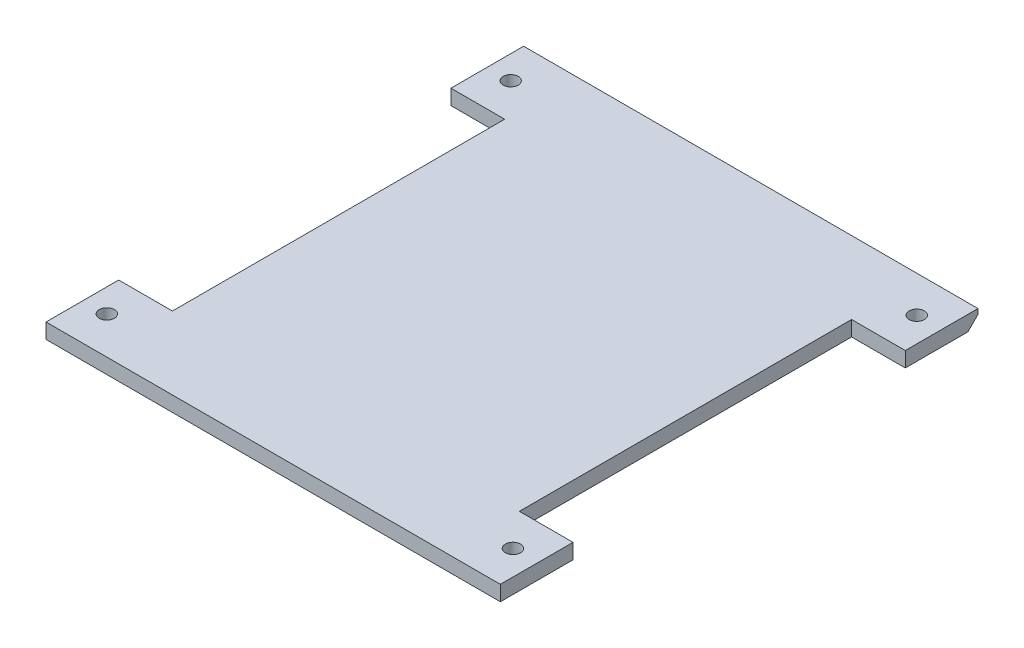
ISO-10303-21;
HEADER;
FILE_DESCRIPTION(('STEP AP214'),'2;1');
FILE_NAME('part.step','',(''),(''),'','','');
FILE_SCHEMA(('AUTOMOTIVE_DESIGN { 1 0 10303 214 1 1 1 1 }'));
ENDSEC;
DATA;
#1=APPLICATION_CONTEXT('core data for automotive mechanical design processes');
#2=APPLICATION_PROTOCOL_DEFINITION('international standard','automotive_design',2000,#1);
#3=PRODUCT_CONTEXT('',#1,'mechanical');
#4=PRODUCT('Part','Part','',(#3));
#5=PRODUCT_RELATED_PRODUCT_CATEGORY('part','',(#4));
#6=PRODUCT_DEFINITION_FORMATION('','',#4);
#7=PRODUCT_DEFINITION_CONTEXT('part definition',#1,'design');
#8=PRODUCT_DEFINITION('design','',#6,#7);
#9=PRODUCT_DEFINITION_SHAPE('','',#8);
#10=(LENGTH_UNIT() NAMED_UNIT(*) SI_UNIT(.MILLI.,.METRE.));
#11=(NAMED_UNIT(*) PLANE_ANGLE_UNIT() SI_UNIT($,.RADIAN.));
#12=(NAMED_UNIT(*) SI_UNIT($,.STERADIAN.) SOLID_ANGLE_UNIT());
#13=UNCERTAINTY_MEASURE_WITH_UNIT(LENGTH_MEASURE(1.E-05),#10,'distance_accuracy_value','');
#14=(GEOMETRIC_REPRESENTATION_CONTEXT(3) GLOBAL_UNCERTAINTY_ASSIGNED_CONTEXT((#13)) GLOBAL_UNIT_ASSIGNED_CONTEXT((#10,
#11,#12)) REPRESENTATION_CONTEXT('',''));
#15=CARTESIAN_POINT('',(0.,0.,0.));
#16=DIRECTION('',(0.,0.,1.));
#17=DIRECTION('',(1.,0.,0.));
#18=AXIS2_PLACEMENT_3D('',#15,#16,#17);
#19=CARTESIAN_POINT('',(45.0000000000001,3.,47.305));
#20=DIRECTION('',(-1.,0.,0.));
#21=DIRECTION('',(0.,0.,1.));
#22=AXIS2_PLACEMENT_3D('',#19,#20,#21);
#23=PLANE('',#22);
#24=DIRECTION('',(0.,0.,-1.));
#25=VECTOR('',#24,1.);
#26=CARTESIAN_POINT('',(45.0000000000001,0.,47.305));
#27=LINE('',#26,#25);
#28=CARTESIAN_POINT('',(45.0000000000001,0.,-32.905));
#29=VERTEX_POINT('',#28);
#30=CARTESIAN_POINT('',(45.0000000000001,0.,-45.305));
#31=VERTEX_POINT('',#30);
#32=EDGE_CURVE('E156',#29,#31,#27,.T.);
#33=ORIENTED_EDGE('',*,*,#32,.T.);
#34=DIRECTION('',(0.,0.707106781186545,-0.70710678118655));
#35=VECTOR('',#34,1.);
#36=CARTESIAN_POINT('',(45.0000000000001,2.,-47.305));
#37=LINE('',#36,#35);
#38=CARTESIAN_POINT('',(45.0000000000001,2.,-47.305));
#39=VERTEX_POINT('',#38);
#40=EDGE_CURVE('E11',#31,#39,#37,.T.);
#41=ORIENTED_EDGE('',*,*,#40,.T.);
#42=DIRECTION('',(0.,-1.,0.));
#43=VECTOR('',#42,1.);
#44=CARTESIAN_POINT('',(45.0000000000001,3.,-47.305));
#45=LINE('',#44,#43);
#46=CARTESIAN_POINT('',(45.0000000000001,3.,-47.305));
#47=VERTEX_POINT('',#46);
#48=EDGE_CURVE('E171',#47,#39,#45,.T.);
#49=ORIENTED_EDGE('',*,*,#48,.F.);
#50=DIRECTION('',(0.,0.,-1.));
#51=VECTOR('',#50,1.);
#52=CARTESIAN_POINT('',(45.0000000000001,3.,47.305));
#53=LINE('',#52,#51);
#54=CARTESIAN_POINT('',(45.0000000000001,3.,-32.905));
#55=VERTEX_POINT('',#54);
#56=EDGE_CURVE('E205',#55,#47,#53,.T.);
#57=ORIENTED_EDGE('',*,*,#56,.F.);
#58=DIRECTION('',(0.,-1.,0.));
#59=VECTOR('',#58,1.);
#60=CARTESIAN_POINT('',(45.0000000000001,3.,-32.905));
#61=LINE('',#60,#59);
#62=EDGE_CURVE('E139',#55,#29,#61,.T.);
#63=ORIENTED_EDGE('',*,*,#62,.T.);
#64=EDGE_LOOP('',(#33,#41,#49,#57,#63));
#65=FACE_BOUND('',#64,.T.);
#66=ADVANCED_FACE('F34',(#65),#23,.F.);
#67=CARTESIAN_POINT('',(-45.0000000000001,3.,47.305));
#68=DIRECTION('',(1.,0.,0.));
#69=DIRECTION('',(0.,0.,-1.));
#70=AXIS2_PLACEMENT_3D('',#67,#68,#69);
#71=PLANE('',#70);
#72=DIRECTION('',(0.,0.,1.));
#73=VECTOR('',#72,1.);
#74=CARTESIAN_POINT('',(-45.0000000000001,3.,47.305));
#75=LINE('',#74,#73);
#76=CARTESIAN_POINT('',(-45.0000000000001,3.,32.905));
#77=VERTEX_POINT('',#76);
#78=CARTESIAN_POINT('',(-45.0000000000001,3.,47.305));
#79=VERTEX_POINT('',#78);
#80=EDGE_CURVE('E199',#77,#79,#75,.T.);
#81=ORIENTED_EDGE('',*,*,#80,.F.);
#82=DIRECTION('',(0.,-1.,0.));
#83=VECTOR('',#82,1.);
#84=CARTESIAN_POINT('',(-45.0000000000001,3.,32.905));
#85=LINE('',#84,#83);
#86=CARTESIAN_POINT('',(-45.0000000000001,0.,32.905));
#87=VERTEX_POINT('',#86);
#88=EDGE_CURVE('E140',#77,#87,#85,.T.);
#89=ORIENTED_EDGE('',*,*,#88,.T.);
#90=DIRECTION('',(0.,0.,1.));
#91=VECTOR('',#90,1.);
#92=CARTESIAN_POINT('',(-45.0000000000001,0.,47.305));
#93=LINE('',#92,#91);
#94=CARTESIAN_POINT('',(-45.0000000000001,0.,47.305));
#95=VERTEX_POINT('',#94);
#96=EDGE_CURVE('E155',#87,#95,#93,.T.);
#97=ORIENTED_EDGE('',*,*,#96,.T.);
#98=DIRECTION('',(0.,-1.,0.));
#99=VECTOR('',#98,1.);
#100=CARTESIAN_POINT('',(-45.0000000000001,3.,47.305));
#101=LINE('',#100,#99);
#102=EDGE_CURVE('E165',#79,#95,#101,.T.);
#103=ORIENTED_EDGE('',*,*,#102,.F.);
#104=EDGE_LOOP('',(#81,#89,#97,#103));
#105=FACE_BOUND('',#104,.T.);
#106=ADVANCED_FACE('F283',(#105),#71,.F.);
#107=CARTESIAN_POINT('',(0.,3.,0.));
#108=DIRECTION('',(0.,-1.,0.));
#109=DIRECTION('',(0.,0.,-1.));
#110=AXIS2_PLACEMENT_3D('',#107,#108,#109);
#111=PLANE('',#110);
#112=DIRECTION('',(0.,0.,-1.));
#113=VECTOR('',#112,1.);
#114=CARTESIAN_POINT('',(34.3600000000002,3.,0.));
#115=LINE('',#114,#113);
#116=CARTESIAN_POINT('',(34.3600000000002,3.,32.905));
#117=VERTEX_POINT('',#116);
#118=CARTESIAN_POINT('',(34.3600000000002,3.,-32.905));
#119=VERTEX_POINT('',#118);
#120=EDGE_CURVE('E252',#117,#119,#115,.T.);
#121=ORIENTED_EDGE('',*,*,#120,.T.);
#122=DIRECTION('',(1.,0.,0.));
#123=VECTOR('',#122,1.);
#124=CARTESIAN_POINT('',(0.,3.,-32.905));
#125=LINE('',#124,#123);
#126=EDGE_CURVE('E255',#119,#55,#125,.T.);
#127=ORIENTED_EDGE('',*,*,#126,.T.);
#128=ORIENTED_EDGE('',*,*,#56,.T.);
#129=DIRECTION('',(-1.,0.,0.));
#130=VECTOR('',#129,1.);
#131=CARTESIAN_POINT('',(45.0000000000001,3.,-47.305));
#132=LINE('',#131,#130);
#133=CARTESIAN_POINT('',(-45.0000000000001,3.,-47.305));
#134=VERTEX_POINT('',#133);
#135=EDGE_CURVE('E200',#47,#134,#132,.T.);
#136=ORIENTED_EDGE('',*,*,#135,.T.);
#137=CARTESIAN_POINT('',(-45.0000000000001,3.,-32.905));
#138=VERTEX_POINT('',#137);
#139=EDGE_CURVE('E169',#134,#138,#75,.T.);
#140=ORIENTED_EDGE('',*,*,#139,.T.);
#141=DIRECTION('',(1.,0.,0.));
#142=VECTOR('',#141,1.);
#143=CARTESIAN_POINT('',(0.,3.,-32.905));
#144=LINE('',#143,#142);
#145=CARTESIAN_POINT('',(-34.3600000000002,3.,-32.905));
#146=VERTEX_POINT('',#145);
#147=EDGE_CURVE('E238',#138,#146,#144,.T.);
#148=ORIENTED_EDGE('',*,*,#147,.T.);
#149=DIRECTION('',(0.,0.,1.));
#150=VECTOR('',#149,1.);
#151=CARTESIAN_POINT('',(-34.3600000000002,3.,0.));
#152=LINE('',#151,#150);
#153=CARTESIAN_POINT('',(-34.3600000000002,3.,32.905));
#154=VERTEX_POINT('',#153);
#155=EDGE_CURVE('E230',#146,#154,#152,.T.);
#156=ORIENTED_EDGE('',*,*,#155,.T.);
#157=DIRECTION('',(-1.,0.,0.));
#158=VECTOR('',#157,1.);
#159=CARTESIAN_POINT('',(0.,3.,32.905));
#160=LINE('',#159,#158);
#161=EDGE_CURVE('E235',#154,#77,#160,.T.);
#162=ORIENTED_EDGE('',*,*,#161,.T.);
#163=ORIENTED_EDGE('',*,*,#80,.T.);
#164=DIRECTION('',(1.,0.,0.));
#165=VECTOR('',#164,1.);
#166=CARTESIAN_POINT('',(45.0000000000001,3.,47.305));
#167=LINE('',#166,#165);
#168=CARTESIAN_POINT('',(45.0000000000001,3.,47.305));
#169=VERTEX_POINT('',#168);
#170=EDGE_CURVE('E164',#79,#169,#167,.T.);
#171=ORIENTED_EDGE('',*,*,#170,.T.);
#172=CARTESIAN_POINT('',(45.0000000000001,3.,32.905));
#173=VERTEX_POINT('',#172);
#174=EDGE_CURVE('E203',#169,#173,#53,.T.);
#175=ORIENTED_EDGE('',*,*,#174,.T.);
#176=DIRECTION('',(-1.,0.,0.));
#177=VECTOR('',#176,1.);
#178=CARTESIAN_POINT('',(0.,3.,32.905));
#179=LINE('',#178,#177);
#180=EDGE_CURVE('E135',#173,#117,#179,.T.);
#181=ORIENTED_EDGE('',*,*,#180,.T.);
#182=EDGE_LOOP('',(#121,#127,#128,#136,#140,#148,#156,#162,#163,#171,#175,#181));
#183=FACE_BOUND('',#182,.T.);
#184=CARTESIAN_POINT('',(40.0828786957527,3.,39.905));
#185=DIRECTION('',(0.,1.,0.));
#186=DIRECTION('',(0.,0.,1.));
#187=AXIS2_PLACEMENT_3D('',#184,#185,#186);
#188=CIRCLE('',#187,1.5);
#189=CARTESIAN_POINT('',(40.0828786957527,3.,41.405));
#190=VERTEX_POINT('',#189);
#191=EDGE_CURVE('E211',#190,#190,#188,.T.);
#192=ORIENTED_EDGE('',*,*,#191,.F.);
#193=EDGE_LOOP('',(#192));
#194=FACE_BOUND('',#193,.T.);
#195=CARTESIAN_POINT('',(-40.3571213042473,3.,39.905));
#196=DIRECTION('',(0.,1.,0.));
#197=DIRECTION('',(0.,0.,1.));
#198=AXIS2_PLACEMENT_3D('',#195,#196,#197);
#199=CIRCLE('',#198,1.49999999999998);
#200=CARTESIAN_POINT('',(-40.3571213042473,3.,41.405));
#201=VERTEX_POINT('',#200);
#202=EDGE_CURVE('E212',#201,#201,#199,.T.);
#203=ORIENTED_EDGE('',*,*,#202,.F.);
#204=EDGE_LOOP('',(#203));
#205=FACE_BOUND('',#204,.T.);
#206=CARTESIAN_POINT('',(40.0828786957527,3.,-40.0949999999999));
#207=DIRECTION('',(0.,1.,0.));
#208=DIRECTION('',(0.,0.,1.));
#209=AXIS2_PLACEMENT_3D('',#206,#207,#208);
#210=CIRCLE('',#209,1.50000000000005);
#211=CARTESIAN_POINT('',(40.0828786957527,3.,-38.5949999999999));
#212=VERTEX_POINT('',#211);
#213=EDGE_CURVE('E218',#212,#212,#210,.T.);
#214=ORIENTED_EDGE('',*,*,#213,.F.);
#215=EDGE_LOOP('',(#214));
#216=FACE_BOUND('',#215,.T.);
#217=CARTESIAN_POINT('',(-40.3571213042473,3.,-40.095));
#218=DIRECTION('',(0.,1.,0.));
#219=DIRECTION('',(0.,0.,1.));
#220=AXIS2_PLACEMENT_3D('',#217,#218,#219);
#221=CIRCLE('',#220,1.5);
#222=CARTESIAN_POINT('',(-40.3571213042473,3.,-38.595));
#223=VERTEX_POINT('',#222);
#224=EDGE_CURVE('E224',#223,#223,#221,.T.);
#225=ORIENTED_EDGE('',*,*,#224,.F.);
#226=EDGE_LOOP('',(#225));
#227=FACE_BOUND('',#226,.T.);
#228=ADVANCED_FACE('F272',(#183,#194,#205,#216,#227),#111,.F.);
#229=CARTESIAN_POINT('',(0.,0.,0.));
#230=DIRECTION('',(0.,-1.,0.));
#231=DIRECTION('',(0.,0.,-1.));
#232=AXIS2_PLACEMENT_3D('',#229,#230,#231);
#233=PLANE('',#232);
#234=CARTESIAN_POINT('',(-45.0000000000001,0.,-45.305));
#235=VERTEX_POINT('',#234);
#236=CARTESIAN_POINT('',(-45.0000000000001,0.,-32.905));
#237=VERTEX_POINT('',#236);
#238=EDGE_CURVE('E158',#235,#237,#93,.T.);
#239=ORIENTED_EDGE('',*,*,#238,.F.);
#240=DIRECTION('',(1.,0.,0.));
#241=VECTOR('',#240,1.);
#242=CARTESIAN_POINT('',(45.0000000000001,0.,-45.305));
#243=LINE('',#242,#241);
#244=EDGE_CURVE('E42',#235,#31,#243,.T.);
#245=ORIENTED_EDGE('',*,*,#244,.T.);
#246=ORIENTED_EDGE('',*,*,#32,.F.);
#247=DIRECTION('',(1.,0.,0.));
#248=VECTOR('',#247,1.);
#249=CARTESIAN_POINT('',(45.0000000000001,0.,-32.905));
#250=LINE('',#249,#248);
#251=CARTESIAN_POINT('',(34.3600000000002,0.,-32.905));
#252=VERTEX_POINT('',#251);
#253=EDGE_CURVE('E262',#252,#29,#250,.T.);
#254=ORIENTED_EDGE('',*,*,#253,.F.);
#255=DIRECTION('',(0.,0.,-1.));
#256=VECTOR('',#255,1.);
#257=CARTESIAN_POINT('',(34.3600000000002,0.,-32.905));
#258=LINE('',#257,#256);
#259=CARTESIAN_POINT('',(34.3600000000002,0.,32.905));
#260=VERTEX_POINT('',#259);
#261=EDGE_CURVE('E149',#260,#252,#258,.T.);
#262=ORIENTED_EDGE('',*,*,#261,.F.);
#263=DIRECTION('',(-1.,0.,0.));
#264=VECTOR('',#263,1.);
#265=CARTESIAN_POINT('',(45.0000000000001,0.,32.905));
#266=LINE('',#265,#264);
#267=CARTESIAN_POINT('',(45.0000000000001,0.,32.905));
#268=VERTEX_POINT('',#267);
#269=EDGE_CURVE('E132',#268,#260,#266,.T.);
#270=ORIENTED_EDGE('',*,*,#269,.F.);
#271=CARTESIAN_POINT('',(45.0000000000001,0.,47.305));
#272=VERTEX_POINT('',#271);
#273=EDGE_CURVE('E145',#272,#268,#27,.T.);
#274=ORIENTED_EDGE('',*,*,#273,.F.);
#275=DIRECTION('',(1.,0.,0.));
#276=VECTOR('',#275,1.);
#277=CARTESIAN_POINT('',(45.0000000000001,0.,47.305));
#278=LINE('',#277,#276);
#279=EDGE_CURVE('E160',#95,#272,#278,.T.);
#280=ORIENTED_EDGE('',*,*,#279,.F.);
#281=ORIENTED_EDGE('',*,*,#96,.F.);
#282=DIRECTION('',(-1.,0.,0.));
#283=VECTOR('',#282,1.);
#284=CARTESIAN_POINT('',(-45.0000000000001,0.,32.905));
#285=LINE('',#284,#283);
#286=CARTESIAN_POINT('',(-34.3600000000002,0.,32.905));
#287=VERTEX_POINT('',#286);
#288=EDGE_CURVE('E243',#287,#87,#285,.T.);
#289=ORIENTED_EDGE('',*,*,#288,.F.);
#290=DIRECTION('',(0.,0.,1.));
#291=VECTOR('',#290,1.);
#292=CARTESIAN_POINT('',(-34.3600000000002,0.,-32.905));
#293=LINE('',#292,#291);
#294=CARTESIAN_POINT('',(-34.3600000000002,0.,-32.905));
#295=VERTEX_POINT('',#294);
#296=EDGE_CURVE('E246',#295,#287,#293,.T.);
#297=ORIENTED_EDGE('',*,*,#296,.F.);
#298=DIRECTION('',(1.,0.,0.));
#299=VECTOR('',#298,1.);
#300=CARTESIAN_POINT('',(-45.0000000000001,0.,-32.905));
#301=LINE('',#300,#299);
#302=EDGE_CURVE('E249',#237,#295,#301,.T.);
#303=ORIENTED_EDGE('',*,*,#302,.F.);
#304=EDGE_LOOP('',(#239,#245,#246,#254,#262,#270,#274,#280,#281,#289,#297,#303));
#305=FACE_BOUND('',#304,.T.);
#306=CARTESIAN_POINT('',(40.0828786957527,0.,-40.0949999999999));
#307=DIRECTION('',(0.,1.,0.));
#308=DIRECTION('',(0.,0.,1.));
#309=AXIS2_PLACEMENT_3D('',#306,#307,#308);
#310=CIRCLE('',#309,1.50000000000005);
#311=CARTESIAN_POINT('',(40.0828786957527,0.,-38.5949999999999));
#312=VERTEX_POINT('',#311);
#313=EDGE_CURVE('E221',#312,#312,#310,.T.);
#314=ORIENTED_EDGE('',*,*,#313,.T.);
#315=EDGE_LOOP('',(#314));
#316=FACE_BOUND('',#315,.T.);
#317=CARTESIAN_POINT('',(40.0828786957527,0.,39.905));
#318=DIRECTION('',(0.,1.,0.));
#319=DIRECTION('',(0.,0.,1.));
#320=AXIS2_PLACEMENT_3D('',#317,#318,#319);
#321=CIRCLE('',#320,1.5);
#322=CARTESIAN_POINT('',(40.0828786957527,0.,41.405));
#323=VERTEX_POINT('',#322);
#324=EDGE_CURVE('E208',#323,#323,#321,.T.);
#325=ORIENTED_EDGE('',*,*,#324,.T.);
#326=EDGE_LOOP('',(#325));
#327=FACE_BOUND('',#326,.T.);
#328=CARTESIAN_POINT('',(-40.3571213042473,0.,39.905));
#329=DIRECTION('',(0.,1.,0.));
#330=DIRECTION('',(0.,0.,1.));
#331=AXIS2_PLACEMENT_3D('',#328,#329,#330);
#332=CIRCLE('',#331,1.49999999999998);
#333=CARTESIAN_POINT('',(-40.3571213042473,0.,41.405));
#334=VERTEX_POINT('',#333);
#335=EDGE_CURVE('E215',#334,#334,#332,.T.);
#336=ORIENTED_EDGE('',*,*,#335,.T.);
#337=EDGE_LOOP('',(#336));
#338=FACE_BOUND('',#337,.T.);
#339=CARTESIAN_POINT('',(-40.3571213042473,0.,-40.095));
#340=DIRECTION('',(0.,1.,0.));
#341=DIRECTION('',(0.,0.,1.));
#342=AXIS2_PLACEMENT_3D('',#339,#340,#341);
#343=CIRCLE('',#342,1.5);
#344=CARTESIAN_POINT('',(-40.3571213042473,0.,-38.595));
#345=VERTEX_POINT('',#344);
#346=EDGE_CURVE('E227',#345,#345,#343,.T.);
#347=ORIENTED_EDGE('',*,*,#346,.T.);
#348=EDGE_LOOP('',(#347));
#349=FACE_BOUND('',#348,.T.);
#350=ADVANCED_FACE('F142',(#305,#316,#327,#338,#349),#233,.T.);
#351=CARTESIAN_POINT('',(45.0000000000001,3.,47.305));
#352=DIRECTION('',(0.,0.,-1.));
#353=DIRECTION('',(-1.,0.,0.));
#354=AXIS2_PLACEMENT_3D('',#351,#352,#353);
#355=PLANE('',#354);
#356=ORIENTED_EDGE('',*,*,#279,.T.);
#357=DIRECTION('',(0.,-1.,0.));
#358=VECTOR('',#357,1.);
#359=CARTESIAN_POINT('',(45.0000000000001,3.,47.305));
#360=LINE('',#359,#358);
#361=EDGE_CURVE('E153',#169,#272,#360,.T.);
#362=ORIENTED_EDGE('',*,*,#361,.F.);
#363=ORIENTED_EDGE('',*,*,#170,.F.);
#364=ORIENTED_EDGE('',*,*,#102,.T.);
#365=EDGE_LOOP('',(#356,#362,#363,#364));
#366=FACE_BOUND('',#365,.T.);
#367=ADVANCED_FACE('F278',(#366),#355,.F.);
#368=ORIENTED_EDGE('',*,*,#273,.T.);
#369=DIRECTION('',(0.,1.,0.));
#370=VECTOR('',#369,1.);
#371=CARTESIAN_POINT('',(45.0000000000001,3.,32.905));
#372=LINE('',#371,#370);
#373=EDGE_CURVE('E128',#268,#173,#372,.T.);
#374=ORIENTED_EDGE('',*,*,#373,.T.);
#375=ORIENTED_EDGE('',*,*,#174,.F.);
#376=ORIENTED_EDGE('',*,*,#361,.T.);
#377=EDGE_LOOP('',(#368,#374,#375,#376));
#378=FACE_BOUND('',#377,.T.);
#379=ADVANCED_FACE('F151',(#378),#23,.F.);
#380=CARTESIAN_POINT('',(45.0000000000001,3.,-47.305));
#381=DIRECTION('',(0.,0.,1.));
#382=DIRECTION('',(1.,0.,0.));
#383=AXIS2_PLACEMENT_3D('',#380,#381,#382);
#384=PLANE('',#383);
#385=ORIENTED_EDGE('',*,*,#48,.T.);
#386=DIRECTION('',(-1.,0.,0.));
#387=VECTOR('',#386,1.);
#388=CARTESIAN_POINT('',(-45.0000000000001,2.,-47.305));
#389=LINE('',#388,#387);
#390=CARTESIAN_POINT('',(-45.0000000000001,2.,-47.305));
#391=VERTEX_POINT('',#390);
#392=EDGE_CURVE('E182',#39,#391,#389,.T.);
#393=ORIENTED_EDGE('',*,*,#392,.T.);
#394=DIRECTION('',(0.,-1.,0.));
#395=VECTOR('',#394,1.);
#396=CARTESIAN_POINT('',(-45.0000000000001,3.,-47.305));
#397=LINE('',#396,#395);
#398=EDGE_CURVE('E168',#134,#391,#397,.T.);
#399=ORIENTED_EDGE('',*,*,#398,.F.);
#400=ORIENTED_EDGE('',*,*,#135,.F.);
#401=EDGE_LOOP('',(#385,#393,#399,#400));
#402=FACE_BOUND('',#401,.T.);
#403=ADVANCED_FACE('F188',(#402),#384,.F.);
#404=ORIENTED_EDGE('',*,*,#398,.T.);
#405=DIRECTION('',(0.,-0.707106781186545,0.70710678118655));
#406=VECTOR('',#405,1.);
#407=CARTESIAN_POINT('',(-45.0000000000001,2.,-47.305));
#408=LINE('',#407,#406);
#409=EDGE_CURVE('E56',#391,#235,#408,.T.);
#410=ORIENTED_EDGE('',*,*,#409,.T.);
#411=ORIENTED_EDGE('',*,*,#238,.T.);
#412=DIRECTION('',(0.,1.,0.));
#413=VECTOR('',#412,1.);
#414=CARTESIAN_POINT('',(-45.0000000000001,3.,-32.905));
#415=LINE('',#414,#413);
#416=EDGE_CURVE('E175',#237,#138,#415,.T.);
#417=ORIENTED_EDGE('',*,*,#416,.T.);
#418=ORIENTED_EDGE('',*,*,#139,.F.);
#419=EDGE_LOOP('',(#404,#410,#411,#417,#418));
#420=FACE_BOUND('',#419,.T.);
#421=ADVANCED_FACE('F194',(#420),#71,.F.);
#422=CARTESIAN_POINT('',(40.0828786957527,3.,39.905));
#423=DIRECTION('',(0.,-1.,0.));
#424=DIRECTION('',(0.,0.,-1.));
#425=AXIS2_PLACEMENT_3D('',#422,#423,#424);
#426=CYLINDRICAL_SURFACE('',#425,1.5);
#427=ORIENTED_EDGE('',*,*,#191,.T.);
#428=EDGE_LOOP('',(#427));
#429=FACE_BOUND('',#428,.T.);
#430=ORIENTED_EDGE('',*,*,#324,.F.);
#431=EDGE_LOOP('',(#430));
#432=FACE_BOUND('',#431,.T.);
#433=ADVANCED_FACE('F322',(#429,#432),#426,.F.);
#434=CARTESIAN_POINT('',(-40.3571213042473,3.,39.905));
#435=DIRECTION('',(0.,-1.,0.));
#436=DIRECTION('',(0.,0.,-1.));
#437=AXIS2_PLACEMENT_3D('',#434,#435,#436);
#438=CYLINDRICAL_SURFACE('',#437,1.49999999999998);
#439=ORIENTED_EDGE('',*,*,#202,.T.);
#440=EDGE_LOOP('',(#439));
#441=FACE_BOUND('',#440,.T.);
#442=ORIENTED_EDGE('',*,*,#335,.F.);
#443=EDGE_LOOP('',(#442));
#444=FACE_BOUND('',#443,.T.);
#445=ADVANCED_FACE('F326',(#441,#444),#438,.F.);
#446=CARTESIAN_POINT('',(40.0828786957527,3.,-40.0949999999999));
#447=DIRECTION('',(0.,-1.,0.));
#448=DIRECTION('',(0.,0.,-1.));
#449=AXIS2_PLACEMENT_3D('',#446,#447,#448);
#450=CYLINDRICAL_SURFACE('',#449,1.50000000000005);
#451=ORIENTED_EDGE('',*,*,#213,.T.);
#452=EDGE_LOOP('',(#451));
#453=FACE_BOUND('',#452,.T.);
#454=ORIENTED_EDGE('',*,*,#313,.F.);
#455=EDGE_LOOP('',(#454));
#456=FACE_BOUND('',#455,.T.);
#457=ADVANCED_FACE('F331',(#453,#456),#450,.F.);
#458=CARTESIAN_POINT('',(-40.3571213042473,3.,-40.095));
#459=DIRECTION('',(0.,-1.,0.));
#460=DIRECTION('',(0.,0.,-1.));
#461=AXIS2_PLACEMENT_3D('',#458,#459,#460);
#462=CYLINDRICAL_SURFACE('',#461,1.5);
#463=ORIENTED_EDGE('',*,*,#224,.T.);
#464=EDGE_LOOP('',(#463));
#465=FACE_BOUND('',#464,.T.);
#466=ORIENTED_EDGE('',*,*,#346,.F.);
#467=EDGE_LOOP('',(#466));
#468=FACE_BOUND('',#467,.T.);
#469=ADVANCED_FACE('F338',(#465,#468),#462,.F.);
#470=CARTESIAN_POINT('',(-34.3600000000002,10.,-32.905));
#471=DIRECTION('',(1.,0.,0.));
#472=DIRECTION('',(0.,0.,-1.));
#473=AXIS2_PLACEMENT_3D('',#470,#471,#472);
#474=PLANE('',#473);
#475=DIRECTION('',(0.,-1.,0.));
#476=VECTOR('',#475,1.);
#477=CARTESIAN_POINT('',(-34.3600000000002,10.,-32.905));
#478=LINE('',#477,#476);
#479=EDGE_CURVE('E241',#146,#295,#478,.T.);
#480=ORIENTED_EDGE('',*,*,#479,.T.);
#481=ORIENTED_EDGE('',*,*,#296,.T.);
#482=DIRECTION('',(0.,-1.,0.));
#483=VECTOR('',#482,1.);
#484=CARTESIAN_POINT('',(-34.3600000000002,10.,32.905));
#485=LINE('',#484,#483);
#486=EDGE_CURVE('E240',#154,#287,#485,.T.);
#487=ORIENTED_EDGE('',*,*,#486,.F.);
#488=ORIENTED_EDGE('',*,*,#155,.F.);
#489=EDGE_LOOP('',(#480,#481,#487,#488));
#490=FACE_BOUND('',#489,.T.);
#491=ADVANCED_FACE('F289',(#490),#474,.F.);
#492=CARTESIAN_POINT('',(-45.0000000000001,10.,32.905));
#493=DIRECTION('',(0.,0.,1.));
#494=DIRECTION('',(1.,0.,0.));
#495=AXIS2_PLACEMENT_3D('',#492,#493,#494);
#496=PLANE('',#495);
#497=ORIENTED_EDGE('',*,*,#486,.T.);
#498=ORIENTED_EDGE('',*,*,#288,.T.);
#499=ORIENTED_EDGE('',*,*,#88,.F.);
#500=ORIENTED_EDGE('',*,*,#161,.F.);
#501=EDGE_LOOP('',(#497,#498,#499,#500));
#502=FACE_BOUND('',#501,.T.);
#503=ADVANCED_FACE('F285',(#502),#496,.F.);
#504=CARTESIAN_POINT('',(-45.0000000000001,10.,-32.905));
#505=DIRECTION('',(0.,0.,-1.));
#506=DIRECTION('',(-1.,0.,0.));
#507=AXIS2_PLACEMENT_3D('',#504,#505,#506);
#508=PLANE('',#507);
#509=ORIENTED_EDGE('',*,*,#416,.F.);
#510=ORIENTED_EDGE('',*,*,#302,.T.);
#511=ORIENTED_EDGE('',*,*,#479,.F.);
#512=ORIENTED_EDGE('',*,*,#147,.F.);
#513=EDGE_LOOP('',(#509,#510,#511,#512));
#514=FACE_BOUND('',#513,.T.);
#515=ADVANCED_FACE('F291',(#514),#508,.F.);
#516=CARTESIAN_POINT('',(34.3600000000002,10.,-32.905));
#517=DIRECTION('',(-1.,0.,0.));
#518=DIRECTION('',(0.,0.,1.));
#519=AXIS2_PLACEMENT_3D('',#516,#517,#518);
#520=PLANE('',#519);
#521=DIRECTION('',(0.,-1.,0.));
#522=VECTOR('',#521,1.);
#523=CARTESIAN_POINT('',(34.3600000000002,10.,32.905));
#524=LINE('',#523,#522);
#525=EDGE_CURVE('E260',#117,#260,#524,.T.);
#526=ORIENTED_EDGE('',*,*,#525,.T.);
#527=ORIENTED_EDGE('',*,*,#261,.T.);
#528=DIRECTION('',(0.,-1.,0.));
#529=VECTOR('',#528,1.);
#530=CARTESIAN_POINT('',(34.3600000000002,10.,-32.905));
#531=LINE('',#530,#529);
#532=EDGE_CURVE('E259',#119,#252,#531,.T.);
#533=ORIENTED_EDGE('',*,*,#532,.F.);
#534=ORIENTED_EDGE('',*,*,#120,.F.);
#535=EDGE_LOOP('',(#526,#527,#533,#534));
#536=FACE_BOUND('',#535,.T.);
#537=ADVANCED_FACE('F267',(#536),#520,.F.);
#538=CARTESIAN_POINT('',(45.0000000000001,10.,-32.905));
#539=DIRECTION('',(0.,0.,-1.));
#540=DIRECTION('',(-1.,0.,0.));
#541=AXIS2_PLACEMENT_3D('',#538,#539,#540);
#542=PLANE('',#541);
#543=ORIENTED_EDGE('',*,*,#532,.T.);
#544=ORIENTED_EDGE('',*,*,#253,.T.);
#545=ORIENTED_EDGE('',*,*,#62,.F.);
#546=ORIENTED_EDGE('',*,*,#126,.F.);
#547=EDGE_LOOP('',(#543,#544,#545,#546));
#548=FACE_BOUND('',#547,.T.);
#549=ADVANCED_FACE('F269',(#548),#542,.F.);
#550=CARTESIAN_POINT('',(45.0000000000001,10.,32.905));
#551=DIRECTION('',(0.,0.,1.));
#552=DIRECTION('',(1.,0.,0.));
#553=AXIS2_PLACEMENT_3D('',#550,#551,#552);
#554=PLANE('',#553);
#555=ORIENTED_EDGE('',*,*,#373,.F.);
#556=ORIENTED_EDGE('',*,*,#269,.T.);
#557=ORIENTED_EDGE('',*,*,#525,.F.);
#558=ORIENTED_EDGE('',*,*,#180,.F.);
#559=EDGE_LOOP('',(#555,#556,#557,#558));
#560=FACE_BOUND('',#559,.T.);
#561=ADVANCED_FACE('F130',(#560),#554,.F.);
#562=CARTESIAN_POINT('',(45.0000000000001,2.,-47.305));
#563=DIRECTION('',(0.,-0.70710678118655,-0.707106781186545));
#564=DIRECTION('',(1.,0.,0.));
#565=AXIS2_PLACEMENT_3D('',#562,#563,#564);
#566=PLANE('',#565);
#567=ORIENTED_EDGE('',*,*,#40,.F.);
#568=ORIENTED_EDGE('',*,*,#244,.F.);
#569=ORIENTED_EDGE('',*,*,#409,.F.);
#570=ORIENTED_EDGE('',*,*,#392,.F.);
#571=EDGE_LOOP('',(#567,#568,#569,#570));
#572=FACE_BOUND('',#571,.T.);
#573=ADVANCED_FACE('F36',(#572),#566,.T.);
#574=CLOSED_SHELL('',(#66,#106,#228,#350,#367,#379,#403,#421,#433,#445,#457,#469,#491,#503,#515,
#537,#549,#561,#573));
#575=MANIFOLD_SOLID_BREP('B2',#574);
#576=ADVANCED_BREP_SHAPE_REPRESENTATION('',(#18,#575),#14);
#577=SHAPE_DEFINITION_REPRESENTATION(#9,#576);
ENDSEC;
END-ISO-10303-21;
